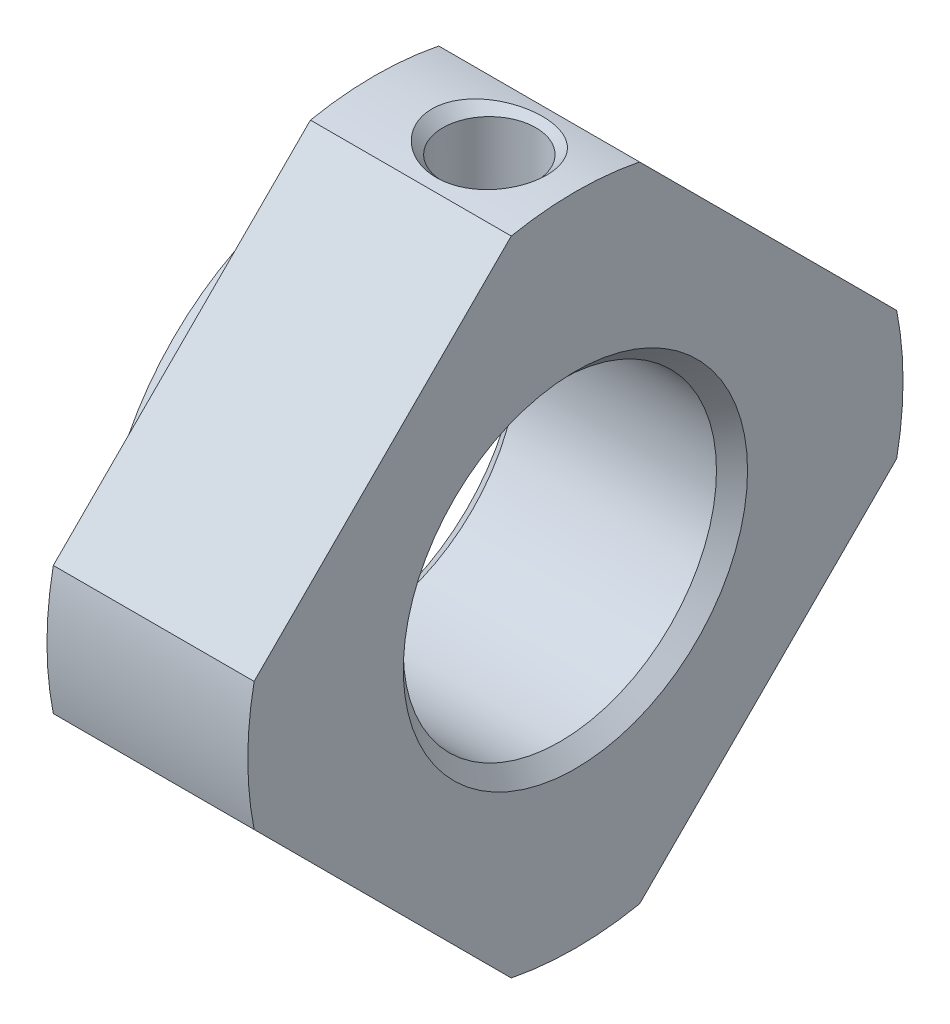
ISO-10303-21;
HEADER;
FILE_DESCRIPTION(('STEP AP214'),'2;1');
FILE_NAME('part.step','',(''),(''),'','','');
FILE_SCHEMA(('AUTOMOTIVE_DESIGN { 1 0 10303 214 1 1 1 1 }'));
ENDSEC;
DATA;
#1=APPLICATION_CONTEXT('core data for automotive mechanical design processes');
#2=APPLICATION_PROTOCOL_DEFINITION('international standard','automotive_design',2000,#1);
#3=PRODUCT_CONTEXT('',#1,'mechanical');
#4=PRODUCT('Part','Part','',(#3));
#5=PRODUCT_RELATED_PRODUCT_CATEGORY('part','',(#4));
#6=PRODUCT_DEFINITION_FORMATION('','',#4);
#7=PRODUCT_DEFINITION_CONTEXT('part definition',#1,'design');
#8=PRODUCT_DEFINITION('design','',#6,#7);
#9=PRODUCT_DEFINITION_SHAPE('','',#8);
#10=(LENGTH_UNIT() NAMED_UNIT(*) SI_UNIT(.MILLI.,.METRE.));
#11=(NAMED_UNIT(*) PLANE_ANGLE_UNIT() SI_UNIT($,.RADIAN.));
#12=(NAMED_UNIT(*) SI_UNIT($,.STERADIAN.) SOLID_ANGLE_UNIT());
#13=UNCERTAINTY_MEASURE_WITH_UNIT(LENGTH_MEASURE(1.E-05),#10,'distance_accuracy_value','');
#14=(GEOMETRIC_REPRESENTATION_CONTEXT(3) GLOBAL_UNCERTAINTY_ASSIGNED_CONTEXT((#13)) GLOBAL_UNIT_ASSIGNED_CONTEXT((#10,
#11,#12)) REPRESENTATION_CONTEXT('',''));
#15=CARTESIAN_POINT('',(0.,0.,0.));
#16=DIRECTION('',(0.,0.,1.));
#17=DIRECTION('',(1.,0.,0.));
#18=AXIS2_PLACEMENT_3D('',#15,#16,#17);
#19=CARTESIAN_POINT('',(27.5,3.00520382004283,-3.00520382004283));
#20=DIRECTION('',(-1.,0.,0.));
#21=DIRECTION('',(0.,0.,1.));
#22=AXIS2_PLACEMENT_3D('',#19,#20,#21);
#23=PLANE('',#22);
#24=CARTESIAN_POINT('',(27.5,0.,0.));
#25=DIRECTION('',(1.,0.,0.));
#26=DIRECTION('',(0.,0.,-1.));
#27=AXIS2_PLACEMENT_3D('',#24,#25,#26);
#28=CIRCLE('',#27,8.5);
#29=CARTESIAN_POINT('',(27.5,0.,-8.5));
#30=VERTEX_POINT('',#29);
#31=EDGE_CURVE('E128',#30,#30,#28,.T.);
#32=ORIENTED_EDGE('',*,*,#31,.F.);
#33=EDGE_LOOP('',(#32));
#34=FACE_BOUND('',#33,.T.);
#35=CARTESIAN_POINT('',(27.5000000000318,0.,0.));
#36=DIRECTION('',(-1.,0.,0.));
#37=DIRECTION('',(0.,0.,1.));
#38=AXIS2_PLACEMENT_3D('',#35,#36,#37);
#39=CIRCLE('',#38,5.99999999997382);
#40=CARTESIAN_POINT('',(27.5000000000318,0.,5.99999999997382));
#41=VERTEX_POINT('',#40);
#42=EDGE_CURVE('E19',#41,#41,#39,.F.);
#43=ORIENTED_EDGE('',*,*,#42,.T.);
#44=EDGE_LOOP('',(#43));
#45=FACE_BOUND('',#44,.T.);
#46=ADVANCED_FACE('F16',(#34,#45),#23,.T.);
#47=CARTESIAN_POINT('',(27.4999999999181,0.,0.));
#48=DIRECTION('',(-1.,0.,0.));
#49=DIRECTION('',(0.,0.,1.));
#50=AXIS2_PLACEMENT_3D('',#47,#48,#49);
#51=CONICAL_SURFACE('',#50,6.00000000008751,0.78539816337393);
#52=CARTESIAN_POINT('',(28.0415,0.,0.));
#53=DIRECTION('',(1.,0.,0.));
#54=DIRECTION('',(0.,0.,-1.));
#55=AXIS2_PLACEMENT_3D('',#52,#53,#54);
#56=CIRCLE('',#55,5.4585);
#57=CARTESIAN_POINT('',(28.0415,0.,-5.4585));
#58=VERTEX_POINT('',#57);
#59=EDGE_CURVE('E126',#58,#58,#56,.T.);
#60=ORIENTED_EDGE('',*,*,#59,.T.);
#61=EDGE_LOOP('',(#60));
#62=FACE_BOUND('',#61,.T.);
#63=ORIENTED_EDGE('',*,*,#42,.F.);
#64=EDGE_LOOP('',(#63));
#65=FACE_BOUND('',#64,.T.);
#66=ADVANCED_FACE('F218',(#62,#65),#51,.F.);
#67=CARTESIAN_POINT('',(32.5,5.52038725808137,0.));
#68=DIRECTION('',(0.,-1.,0.));
#69=DIRECTION('',(0.,0.,-1.));
#70=AXIS2_PLACEMENT_3D('',#67,#68,#69);
#71=CYLINDRICAL_SURFACE('',#70,1.621);
#72=CARTESIAN_POINT('',(34.121,5.4585,0.));
#73=CARTESIAN_POINT('',(34.1209961886155,5.45849743623701,0.0889206585538135));
#74=CARTESIAN_POINT('',(34.113654997219,5.45630490165427,0.177888735296105));
#75=CARTESIAN_POINT('',(34.084536910865,5.44776573714506,0.353272767348448));
#76=CARTESIAN_POINT('',(34.0627467681571,5.44141529504247,0.439686304466254));
#77=CARTESIAN_POINT('',(34.0055224305635,5.42525856871914,0.607351492799735));
#78=CARTESIAN_POINT('',(33.9701114372025,5.41545816350175,0.688611649492608));
#79=CARTESIAN_POINT('',(33.8867353981946,5.39342239097826,0.844029913027432));
#80=CARTESIAN_POINT('',(33.8387702475975,5.3811870033164,0.918187960490084));
#81=CARTESIAN_POINT('',(33.7302177277437,5.35520078563058,1.05940394948613));
#82=CARTESIAN_POINT('',(33.6693403170053,5.34141932361196,1.12623329643226));
#83=CARTESIAN_POINT('',(33.5373088004777,5.31407809936427,1.24890115724466));
#84=CARTESIAN_POINT('',(33.4661528256401,5.30051837795667,1.30473766780679));
#85=CARTESIAN_POINT('',(33.3136654500253,5.27483390580349,1.40502518157018));
#86=CARTESIAN_POINT('',(33.2321449632029,5.26274719111901,1.4491993342705));
#87=CARTESIAN_POINT('',(33.0624158617074,5.24183336856109,1.52311899878821));
#88=CARTESIAN_POINT('',(32.9742088337975,5.23300549024342,1.55286792149689));
#89=CARTESIAN_POINT('',(32.7961692555644,5.21992715838836,1.59627293865551));
#90=CARTESIAN_POINT('',(32.706448083657,5.21555752071649,1.61034902126006));
#91=CARTESIAN_POINT('',(32.5258193785475,5.21153570655092,1.62332007558974));
#92=CARTESIAN_POINT('',(32.4349121302007,5.21188241745167,1.62221862775439));
#93=CARTESIAN_POINT('',(32.2578940590897,5.21714839715069,1.6051961073405));
#94=CARTESIAN_POINT('',(32.1717271953187,5.22190583905855,1.58979948675403));
#95=CARTESIAN_POINT('',(32.0032587345288,5.23519573019746,1.54547016424812));
#96=CARTESIAN_POINT('',(31.9209575326809,5.24372856444653,1.51653608174847));
#97=CARTESIAN_POINT('',(31.7612642444718,5.2637384501903,1.44556215764327));
#98=CARTESIAN_POINT('',(31.6839534725747,5.27525370949486,1.40335058892701));
#99=CARTESIAN_POINT('',(31.5373407239325,5.29991150605148,1.30714192458887));
#100=CARTESIAN_POINT('',(31.468040181307,5.31305433382712,1.25314272353973));
#101=CARTESIAN_POINT('',(31.3364437148988,5.34014278510104,1.13228923835277));
#102=CARTESIAN_POINT('',(31.2745478729898,5.35409930723367,1.06500106888445));
#103=CARTESIAN_POINT('',(31.1628033114902,5.38077348874249,0.920797271284167));
#104=CARTESIAN_POINT('',(31.1129597698257,5.39349061425172,0.843877526685428));
#105=CARTESIAN_POINT('',(31.0264975121381,5.41636736276875,0.681855027854556));
#106=CARTESIAN_POINT('',(30.9899762177362,5.4265079873945,0.596697536899453));
#107=CARTESIAN_POINT('',(30.9319565349538,5.44293648039843,0.421175800449859));
#108=CARTESIAN_POINT('',(30.9104271292629,5.44923230010362,0.330822726385305));
#109=CARTESIAN_POINT('',(30.8908513191087,5.45499014012378,0.199726232576861));
#110=CARTESIAN_POINT('',(30.8864119958305,5.45630273196246,0.159928368441251));
#111=CARTESIAN_POINT('',(30.8804852461224,5.45805837825115,0.0800936220278539));
#112=CARTESIAN_POINT('',(30.8789978310507,5.4585014293554,0.040056738830981));
#113=CARTESIAN_POINT('',(30.879004811151,5.45849682941205,-0.0888536283595229));
#114=CARTESIAN_POINT('',(30.8863389503648,5.45630664348281,-0.17780495409913));
#115=CARTESIAN_POINT('',(30.9154442680936,5.44777129150553,-0.35320680804383));
#116=CARTESIAN_POINT('',(30.9372409792289,5.44141877741786,-0.43965263076351));
#117=CARTESIAN_POINT('',(30.9944807265443,5.42525765441628,-0.607358521486695));
#118=CARTESIAN_POINT('',(31.0298962091286,5.41545602715085,-0.68862867643747));
#119=CARTESIAN_POINT('',(31.1132749962464,5.39341975895458,-0.844046513091637));
#120=CARTESIAN_POINT('',(31.1612356986506,5.38118562270082,-0.918195667477493));
#121=CARTESIAN_POINT('',(31.2697761002246,5.35520221920627,-1.05939594950148));
#122=CARTESIAN_POINT('',(31.3306457476413,5.34142232832322,-1.12621855631329));
#123=CARTESIAN_POINT('',(31.4626762092437,5.31408108504718,-1.24888902346652));
#124=CARTESIAN_POINT('',(31.5338411349633,5.3005198223821,-1.30473247804267));
#125=CARTESIAN_POINT('',(31.6863699856458,5.274827500423,-1.4050497318084));
#126=CARTESIAN_POINT('',(31.767926244021,5.26273516125766,-1.44924165400647));
#127=CARTESIAN_POINT('',(31.9376795037206,5.24182486763569,-1.52314922914898));
#128=CARTESIAN_POINT('',(32.0258683253884,5.23300295703768,-1.55288238610646));
#129=CARTESIAN_POINT('',(32.1787320695568,5.22176866410543,-1.59015704805108));
#130=CARTESIAN_POINT('',(32.2423758738042,5.21822206471239,-1.60170095840048));
#131=CARTESIAN_POINT('',(32.3706714132873,5.21346319757077,-1.61712360936526));
#132=CARTESIAN_POINT('',(32.4353230849455,5.21225078317488,-1.62100283152206));
#133=CARTESIAN_POINT('',(32.5888233147465,5.21225602487028,-1.62099611136099));
#134=CARTESIAN_POINT('',(32.677694240037,5.21454990902273,-1.6136704390148));
#135=CARTESIAN_POINT('',(32.852876102856,5.22344941293933,-1.58461959405366));
#136=CARTESIAN_POINT('',(32.9391845436766,5.23005910233262,-1.56288083018005));
#137=CARTESIAN_POINT('',(33.1066278750054,5.24677479987347,-1.50580625277781));
#138=CARTESIAN_POINT('',(33.1877720899323,5.25687428185043,-1.4704958055549));
#139=CARTESIAN_POINT('',(33.3429913036853,5.27942305485905,-1.38735783534013));
#140=CARTESIAN_POINT('',(33.4170662887768,5.29187235045595,-1.33953028802991));
#141=CARTESIAN_POINT('',(33.5583541813039,5.31815154067366,-1.23112799508929));
#142=CARTESIAN_POINT('',(33.6253162264031,5.33201037206857,-1.17023323125493));
#143=CARTESIAN_POINT('',(33.7482571689267,5.35930272116547,-1.03809494581458));
#144=CARTESIAN_POINT('',(33.8042324871722,5.37273609907492,-0.966848064879404));
#145=CARTESIAN_POINT('',(33.9046992654535,5.39799437896844,-0.814234818856837));
#146=CARTESIAN_POINT('',(33.9489301749715,5.40978040980222,-0.73269010726574));
#147=CARTESIAN_POINT('',(34.0229133623526,5.43006179605436,-0.562960320124672));
#148=CARTESIAN_POINT('',(34.0526826106671,5.43856100608563,-0.474783168675178));
#149=CARTESIAN_POINT('',(34.0900491628168,5.44936985520847,-0.321826382069556));
#150=CARTESIAN_POINT('',(34.1016338173234,5.45277521754963,-0.258069839379326));
#151=CARTESIAN_POINT('',(34.117110414871,5.45734116278398,-0.129550551964768));
#152=CARTESIAN_POINT('',(34.1210027769863,5.45850186796551,-0.064787862248856));
#153=CARTESIAN_POINT('',(34.121,5.4585,0.));
#154=B_SPLINE_CURVE_WITH_KNOTS('',3,(#72,#73,#74,#75,#76,#77,#78,#79,#80,#81,#82,#83,#84,#85,
#86,#87,#88,#89,#90,#91,#92,#93,#94,#95,#96,#97,#98,#99,#100,#101,#102,#103,#104,#105,#106,#107,
#108,#109,#110,#111,#112,#113,#114,#115,#116,#117,#118,#119,#120,#121,#122,#123,#124,#125,#126,
#127,#128,#129,#130,#131,#132,#133,#134,#135,#136,#137,#138,#139,#140,#141,#142,#143,#144,#145,
#146,#147,#148,#149,#150,#151,#152,#153),.UNSPECIFIED.,.T.,.F.,(4,2,2,2,2,2,2,2,2,2,2,2,2,2,2,2,
2,2,2,2,2,2,2,2,2,2,2,2,2,2,2,2,2,2,2,2,2,2,2,2,4),(0.,0.26652021598874,0.533285133775967,
0.799597646754547,1.06591238612386,1.33900151797797,1.61214037086847,1.89127534098169,
2.1703442765238,2.44174010967952,2.71307192058006,2.97482668868271,3.2366081569342,
3.50192521708651,3.76728970521141,4.04345868744016,4.31974610780301,4.59801524667118,
4.87570693913836,4.99580722068861,5.11590796435144,5.38231474519665,5.64919310371663,
5.91553432899406,6.18182035352548,6.45487966978344,6.7280483379025,7.00731976714434,
7.28625225898179,7.48011870212588,7.6739729650366,7.94020053935682,8.20667951872104,
8.47266283576829,8.73864666957479,9.01209373193519,9.28562972864552,9.56480511596207,
9.84365210075378,10.0378501208238,10.2320375607376),.UNSPECIFIED.);
#155=CARTESIAN_POINT('',(34.121,5.4585,0.));
#156=VERTEX_POINT('',#155);
#157=EDGE_CURVE('E125',#156,#156,#154,.T.);
#158=ORIENTED_EDGE('',*,*,#157,.T.);
#159=EDGE_LOOP('',(#158));
#160=FACE_BOUND('',#159,.T.);
#161=CARTESIAN_POINT('',(32.5,11.0407745161183,0.));
#162=DIRECTION('',(0.,1.,0.));
#163=DIRECTION('',(1.,0.,0.));
#164=AXIS2_PLACEMENT_3D('',#161,#162,#163);
#165=CIRCLE('',#164,1.62099999997053);
#166=CARTESIAN_POINT('',(34.1209999999705,11.0407745161183,0.));
#167=VERTEX_POINT('',#166);
#168=EDGE_CURVE('E122',#167,#167,#165,.T.);
#169=ORIENTED_EDGE('',*,*,#168,.T.);
#170=EDGE_LOOP('',(#169));
#171=FACE_BOUND('',#170,.T.);
#172=ADVANCED_FACE('F221',(#160,#171),#71,.F.);
#173=CARTESIAN_POINT('',(28.,0.,0.));
#174=DIRECTION('',(1.,0.,0.));
#175=DIRECTION('',(0.,0.,-1.));
#176=AXIS2_PLACEMENT_3D('',#173,#174,#175);
#177=CYLINDRICAL_SURFACE('',#176,8.5);
#178=ORIENTED_EDGE('',*,*,#31,.T.);
#179=EDGE_LOOP('',(#178));
#180=FACE_BOUND('',#179,.T.);
#181=CARTESIAN_POINT('',(28.5,0.,0.));
#182=DIRECTION('',(1.,0.,0.));
#183=DIRECTION('',(0.,0.,-1.));
#184=AXIS2_PLACEMENT_3D('',#181,#182,#183);
#185=CIRCLE('',#184,8.5);
#186=CARTESIAN_POINT('',(28.5,0.,-8.5));
#187=VERTEX_POINT('',#186);
#188=EDGE_CURVE('E121',#187,#187,#185,.T.);
#189=ORIENTED_EDGE('',*,*,#188,.F.);
#190=EDGE_LOOP('',(#189));
#191=FACE_BOUND('',#190,.T.);
#192=ADVANCED_FACE('F212',(#180,#191),#177,.T.);
#193=CARTESIAN_POINT('',(31.5,0.,0.));
#194=DIRECTION('',(1.,0.,0.));
#195=DIRECTION('',(0.,0.,-1.));
#196=AXIS2_PLACEMENT_3D('',#193,#194,#195);
#197=CYLINDRICAL_SURFACE('',#196,5.4585);
#198=CARTESIAN_POINT('',(34.9585000000729,0.,0.));
#199=DIRECTION('',(1.,0.,0.));
#200=DIRECTION('',(0.,0.707106781191754,-0.707106781181341));
#201=AXIS2_PLACEMENT_3D('',#198,#199,#200);
#202=CIRCLE('',#201,5.45850000000221);
#203=CARTESIAN_POINT('',(34.9585000000729,3.85974236513675,-3.85974236507991));
#204=VERTEX_POINT('',#203);
#205=EDGE_CURVE('E115',#204,#204,#202,.T.);
#206=ORIENTED_EDGE('',*,*,#205,.T.);
#207=EDGE_LOOP('',(#206));
#208=FACE_BOUND('',#207,.T.);
#209=ORIENTED_EDGE('',*,*,#157,.F.);
#210=EDGE_LOOP('',(#209));
#211=FACE_BOUND('',#210,.T.);
#212=ORIENTED_EDGE('',*,*,#59,.F.);
#213=EDGE_LOOP('',(#212));
#214=FACE_BOUND('',#213,.T.);
#215=ADVANCED_FACE('F192',(#208,#211,#214),#197,.F.);
#216=CARTESIAN_POINT('',(32.5,11.4220485160672,0.));
#217=DIRECTION('',(0.,1.,0.));
#218=DIRECTION('',(0.,0.,1.));
#219=AXIS2_PLACEMENT_3D('',#216,#217,#218);
#220=CONICAL_SURFACE('',#219,2.00227399991945,0.785398163397448);
#221=ORIENTED_EDGE('',*,*,#168,.F.);
#222=EDGE_LOOP('',(#221));
#223=FACE_BOUND('',#222,.T.);
#224=CARTESIAN_POINT('',(34.5000000000149,11.4197745161627,0.));
#225=CARTESIAN_POINT('',(34.4999941499019,11.4197727655796,0.0994875831042441));
#226=CARTESIAN_POINT('',(34.491224091906,11.4184581870759,0.199125114776996));
#227=CARTESIAN_POINT('',(34.4565148715457,11.4133508338645,0.395431044957858));
#228=CARTESIAN_POINT('',(34.4305373203595,11.409552518341,0.492092297843787));
#229=CARTESIAN_POINT('',(34.3640006141568,11.4001288573928,0.675576376469557));
#230=CARTESIAN_POINT('',(34.3240941756522,11.3945862388823,0.762641327297832));
#231=CARTESIAN_POINT('',(34.2311095271603,11.3822120755062,0.929238851068744));
#232=CARTESIAN_POINT('',(34.1780365092973,11.3753810389707,1.0087743761335));
#233=CARTESIAN_POINT('',(34.0569336315231,11.3606564157836,1.16323430494634));
#234=CARTESIAN_POINT('',(33.9882029011001,11.3527238248726,1.23760467388356));
#235=CARTESIAN_POINT('',(33.840015638807,11.3369323080981,1.37477060259231));
#236=CARTESIAN_POINT('',(33.7605542612448,11.3290734172404,1.43756090261296));
#237=CARTESIAN_POINT('',(33.5863911908744,11.3135753729889,1.55500953110717));
#238=CARTESIAN_POINT('',(33.490980304287,11.3060032489396,1.60862587312343));
#239=CARTESIAN_POINT('',(33.2928184345414,11.2925920428021,1.70022450794446));
#240=CARTESIAN_POINT('',(33.190065405833,11.2867534460356,1.73820242373409));
#241=CARTESIAN_POINT('',(32.9734397747627,11.2771148438365,1.79971399740518));
#242=CARTESIAN_POINT('',(32.8592708478516,11.2734601762491,1.82223038323829));
#243=CARTESIAN_POINT('',(32.6287360043332,11.2691731524432,1.84855735515637));
#244=CARTESIAN_POINT('',(32.5123697109535,11.2685413193483,1.85236470350871));
#245=CARTESIAN_POINT('',(32.277496689203,11.2703955810692,1.84105154816222));
#246=CARTESIAN_POINT('',(32.159014339814,11.2729642591193,1.82542973010839));
#247=CARTESIAN_POINT('',(31.9263855050091,11.2810629875564,1.77468901263029));
#248=CARTESIAN_POINT('',(31.8122394373828,11.2865933225203,1.73956823959663));
#249=CARTESIAN_POINT('',(31.5920261539413,11.2999397995278,1.65064142976966));
#250=CARTESIAN_POINT('',(31.4859339842897,11.3077484848979,1.59689624165888));
#251=CARTESIAN_POINT('',(31.2848155528144,11.3247141334314,1.47175750986445));
#252=CARTESIAN_POINT('',(31.1897873421787,11.333870858505,1.40036708116261));
#253=CARTESIAN_POINT('',(31.0175279401797,11.3520216832855,1.24449388221329));
#254=CARTESIAN_POINT('',(30.9397642133924,11.3610090645174,1.16060036251935));
#255=CARTESIAN_POINT('',(30.8007673795143,11.3780152508686,0.979907331600733));
#256=CARTESIAN_POINT('',(30.7395332908561,11.3860341134852,0.883108587227762));
#257=CARTESIAN_POINT('',(30.6403828060021,11.3994744083439,0.687132972390269));
#258=CARTESIAN_POINT('',(30.6010668314366,11.4050450671979,0.588673226551313));
#259=CARTESIAN_POINT('',(30.5410443478022,11.4136846773793,0.38630024153933));
#260=CARTESIAN_POINT('',(30.5202840983493,11.4167608507246,0.282403679496009));
#261=CARTESIAN_POINT('',(30.5061960003211,11.4188524096086,0.148134787711536));
#262=CARTESIAN_POINT('',(30.5038749697676,11.4191974684681,0.118560984363502));
#263=CARTESIAN_POINT('',(30.5007760671146,11.4196587872578,0.0593292353655991));
#264=CARTESIAN_POINT('',(30.4999982552409,11.4197750382585,0.0296712864770879));
#265=CARTESIAN_POINT('',(30.5000058500981,11.4197727655796,-0.0994875831042423));
#266=CARTESIAN_POINT('',(30.508775908094,11.4184581870759,-0.199125114776995));
#267=CARTESIAN_POINT('',(30.5434851284543,11.4133508338645,-0.395431044957856));
#268=CARTESIAN_POINT('',(30.5694626796405,11.409552518341,-0.492092297843785));
#269=CARTESIAN_POINT('',(30.6359993858432,11.4001288573928,-0.675576376469554));
#270=CARTESIAN_POINT('',(30.6759058243478,11.3945862388823,-0.762641327297831));
#271=CARTESIAN_POINT('',(30.7688904728397,11.3822120755062,-0.929238851068743));
#272=CARTESIAN_POINT('',(30.8219634907027,11.3753810389707,-1.0087743761335));
#273=CARTESIAN_POINT('',(30.9430663684769,11.3606564157836,-1.16323430494634));
#274=CARTESIAN_POINT('',(31.0117970988999,11.3527238248726,-1.23760467388356));
#275=CARTESIAN_POINT('',(31.159984361193,11.3369323080981,-1.37477060259231));
#276=CARTESIAN_POINT('',(31.2394457387552,11.3290734172404,-1.43756090261296));
#277=CARTESIAN_POINT('',(31.4136088091256,11.3135753729889,-1.55500953110717));
#278=CARTESIAN_POINT('',(31.509019695713,11.3060032489396,-1.60862587312343));
#279=CARTESIAN_POINT('',(31.7071815654586,11.2925920428021,-1.70022450794446));
#280=CARTESIAN_POINT('',(31.809934594167,11.2867534460356,-1.73820242373409));
#281=CARTESIAN_POINT('',(32.0265602252373,11.2771148438365,-1.79971399740518));
#282=CARTESIAN_POINT('',(32.1407291521484,11.2734601762491,-1.82223038323828));
#283=CARTESIAN_POINT('',(32.3712639956668,11.2691731524432,-1.84855735515637));
#284=CARTESIAN_POINT('',(32.4876302890465,11.2685413193483,-1.85236470350871));
#285=CARTESIAN_POINT('',(32.722503310797,11.2703955810692,-1.84105154816222));
#286=CARTESIAN_POINT('',(32.840985660186,11.2729642591193,-1.82542973010839));
#287=CARTESIAN_POINT('',(33.0736144949909,11.2810629875564,-1.77468901263029));
#288=CARTESIAN_POINT('',(33.1877605626172,11.2865933225203,-1.73956823959663));
#289=CARTESIAN_POINT('',(33.4079738460587,11.2999397995278,-1.65064142976965));
#290=CARTESIAN_POINT('',(33.5140660157103,11.3077484848979,-1.59689624165887));
#291=CARTESIAN_POINT('',(33.7151844471856,11.3247141334314,-1.47175750986445));
#292=CARTESIAN_POINT('',(33.8102126578213,11.333870858505,-1.40036708116261));
#293=CARTESIAN_POINT('',(33.9824720598203,11.3520216832855,-1.24449388221329));
#294=CARTESIAN_POINT('',(34.0602357866076,11.3610090645174,-1.16060036251935));
#295=CARTESIAN_POINT('',(34.1992326204857,11.3780152508686,-0.979907331600738));
#296=CARTESIAN_POINT('',(34.2604667091439,11.3860341134852,-0.883108587227766));
#297=CARTESIAN_POINT('',(34.3596171939979,11.3994744083439,-0.687132972390272));
#298=CARTESIAN_POINT('',(34.3989331685634,11.4050450671979,-0.588673226551317));
#299=CARTESIAN_POINT('',(34.4589556521978,11.4136846773793,-0.386300241539334));
#300=CARTESIAN_POINT('',(34.4797159016507,11.4167608507246,-0.282403679496012));
#301=CARTESIAN_POINT('',(34.4938039996789,11.4188524096086,-0.148134787711537));
#302=CARTESIAN_POINT('',(34.4961250302324,11.4191974684681,-0.118560984363502));
#303=CARTESIAN_POINT('',(34.4992239328854,11.4196587872578,-0.0593292353655976));
#304=CARTESIAN_POINT('',(34.5000017447591,11.4197750382585,-0.0296712864770861));
#305=CARTESIAN_POINT('',(34.5000000000149,11.4197745161627,0.));
#306=B_SPLINE_CURVE_WITH_KNOTS('',3,(#224,#225,#226,#227,#228,#229,#230,#231,#232,#233,#234,
#235,#236,#237,#238,#239,#240,#241,#242,#243,#244,#245,#246,#247,#248,#249,#250,#251,#252,#253,
#254,#255,#256,#257,#258,#259,#260,#261,#262,#263,#264,#265,#266,#267,#268,#269,#270,#271,#272,
#273,#274,#275,#276,#277,#278,#279,#280,#281,#282,#283,#284,#285,#286,#287,#288,#289,#290,#291,
#292,#293,#294,#295,#296,#297,#298,#299,#300,#301,#302,#303,#304,#305),.UNSPECIFIED.,.T.,.F.,(4,
2,2,2,2,2,2,2,2,2,2,2,2,2,2,2,2,2,2,2,2,2,2,2,2,2,2,2,2,2,2,2,2,2,2,2,2,2,2,2,4),(0.,
0.298338349790301,0.597344525228967,0.883891221380903,1.17032509949198,1.47376304814603,
1.7773384828834,2.10502544086517,2.43280405240925,2.78048873926797,3.12823359332801,
3.48514010494892,3.84208091682601,4.19786637768405,4.55358907517742,4.89601278291427,
5.23841615227901,5.55525555710707,5.87117434221565,5.96014762838237,6.0491243867629,
6.3474627365532,6.64646891199186,6.9330156081438,7.21944948625488,7.52288743490893,
7.82646286964629,8.15414982762806,8.48192843917215,8.82961312603086,9.1773579800909,
9.53426449171182,9.89120530358891,10.2469907644469,10.6027134619403,10.9451371696772,
11.2875405390419,11.60437994387,11.9202987289785,12.0092720151453,12.0982487735258),.UNSPECIFIED.);
#307=CARTESIAN_POINT('',(34.5000000000149,11.4197745161627,0.));
#308=VERTEX_POINT('',#307);
#309=EDGE_CURVE('E149',#308,#308,#306,.T.);
#310=ORIENTED_EDGE('',*,*,#309,.F.);
#311=EDGE_LOOP('',(#310));
#312=FACE_BOUND('',#311,.T.);
#313=ADVANCED_FACE('F156',(#223,#312),#220,.F.);
#314=CARTESIAN_POINT('',(28.5,7.04270382004283,-7.04270382004283));
#315=DIRECTION('',(-1.,0.,0.));
#316=DIRECTION('',(0.,0.,1.));
#317=AXIS2_PLACEMENT_3D('',#314,#315,#316);
#318=PLANE('',#317);
#319=ORIENTED_EDGE('',*,*,#188,.T.);
#320=EDGE_LOOP('',(#319));
#321=FACE_BOUND('',#320,.T.);
#322=DIRECTION('',(0.,-0.707106781186548,0.707106781186547));
#323=VECTOR('',#322,1.);
#324=CARTESIAN_POINT('',(28.5,-13.4350288425444,0.));
#325=LINE('',#324,#323);
#326=CARTESIAN_POINT('',(28.5,-2.23637338354533,-11.198655458999));
#327=VERTEX_POINT('',#326);
#328=CARTESIAN_POINT('',(28.5,-11.1986554589991,-2.23637338354533));
#329=VERTEX_POINT('',#328);
#330=EDGE_CURVE('E82',#327,#329,#325,.T.);
#331=ORIENTED_EDGE('',*,*,#330,.T.);
#332=CARTESIAN_POINT('',(28.5,0.,0.));
#333=DIRECTION('',(1.,0.,0.));
#334=DIRECTION('',(0.,0.,-1.));
#335=AXIS2_PLACEMENT_3D('',#332,#333,#334);
#336=CIRCLE('',#335,11.4197745161627);
#337=CARTESIAN_POINT('',(28.5,-11.198655458999,2.23637338354533));
#338=VERTEX_POINT('',#337);
#339=EDGE_CURVE('E85',#338,#329,#336,.T.);
#340=ORIENTED_EDGE('',*,*,#339,.F.);
#341=DIRECTION('',(0.,0.707106781186547,0.707106781186548));
#342=VECTOR('',#341,1.);
#343=CARTESIAN_POINT('',(28.5,0.,13.4350288425444));
#344=LINE('',#343,#342);
#345=CARTESIAN_POINT('',(28.5,-2.23637338354533,11.198655458999));
#346=VERTEX_POINT('',#345);
#347=EDGE_CURVE('E77',#338,#346,#344,.T.);
#348=ORIENTED_EDGE('',*,*,#347,.T.);
#349=CARTESIAN_POINT('',(28.5,0.,0.));
#350=DIRECTION('',(1.,0.,0.));
#351=DIRECTION('',(0.,0.,-1.));
#352=AXIS2_PLACEMENT_3D('',#349,#350,#351);
#353=CIRCLE('',#352,11.4197745161627);
#354=CARTESIAN_POINT('',(28.5,2.23637338354533,11.198655458999));
#355=VERTEX_POINT('',#354);
#356=EDGE_CURVE('E143',#355,#346,#353,.T.);
#357=ORIENTED_EDGE('',*,*,#356,.F.);
#358=DIRECTION('',(0.,0.707106781186548,-0.707106781186547));
#359=VECTOR('',#358,1.);
#360=CARTESIAN_POINT('',(28.5,13.4350288425444,0.));
#361=LINE('',#360,#359);
#362=CARTESIAN_POINT('',(28.5,11.1986554589991,2.23637338354533));
#363=VERTEX_POINT('',#362);
#364=EDGE_CURVE('E110',#355,#363,#361,.T.);
#365=ORIENTED_EDGE('',*,*,#364,.T.);
#366=CARTESIAN_POINT('',(28.5,0.,0.));
#367=DIRECTION('',(1.,0.,0.));
#368=DIRECTION('',(0.,0.,-1.));
#369=AXIS2_PLACEMENT_3D('',#366,#367,#368);
#370=CIRCLE('',#369,11.4197745161627);
#371=CARTESIAN_POINT('',(28.5,11.198655458999,-2.23637338354533));
#372=VERTEX_POINT('',#371);
#373=EDGE_CURVE('E113',#372,#363,#370,.T.);
#374=ORIENTED_EDGE('',*,*,#373,.F.);
#375=DIRECTION('',(0.,-0.707106781186547,-0.707106781186548));
#376=VECTOR('',#375,1.);
#377=CARTESIAN_POINT('',(28.5,0.,-13.4350288425444));
#378=LINE('',#377,#376);
#379=CARTESIAN_POINT('',(28.5,2.23637338354533,-11.1986554589991));
#380=VERTEX_POINT('',#379);
#381=EDGE_CURVE('E116',#372,#380,#378,.T.);
#382=ORIENTED_EDGE('',*,*,#381,.T.);
#383=CARTESIAN_POINT('',(28.5,0.,0.));
#384=DIRECTION('',(1.,0.,0.));
#385=DIRECTION('',(0.,0.,-1.));
#386=AXIS2_PLACEMENT_3D('',#383,#384,#385);
#387=CIRCLE('',#386,11.4197745161627);
#388=EDGE_CURVE('E88',#327,#380,#387,.T.);
#389=ORIENTED_EDGE('',*,*,#388,.F.);
#390=EDGE_LOOP('',(#331,#340,#348,#357,#365,#374,#382,#389));
#391=FACE_BOUND('',#390,.T.);
#392=ADVANCED_FACE('F84',(#321,#391),#318,.T.);
#393=CARTESIAN_POINT('',(35.4999999999563,0.,0.));
#394=DIRECTION('',(1.,0.,0.));
#395=DIRECTION('',(0.,0.,-1.));
#396=AXIS2_PLACEMENT_3D('',#393,#394,#395);
#397=CONICAL_SURFACE('',#396,5.99999999992673,0.785398163435422);
#398=CARTESIAN_POINT('',(35.5000000000367,0.,0.));
#399=DIRECTION('',(1.,0.,0.));
#400=DIRECTION('',(0.,0.,-1.));
#401=AXIS2_PLACEMENT_3D('',#398,#399,#400);
#402=CIRCLE('',#401,6.00000000000712);
#403=CARTESIAN_POINT('',(35.5000000000367,0.,-6.00000000000712));
#404=VERTEX_POINT('',#403);
#405=EDGE_CURVE('E140',#404,#404,#402,.F.);
#406=ORIENTED_EDGE('',*,*,#405,.F.);
#407=EDGE_LOOP('',(#406));
#408=FACE_BOUND('',#407,.T.);
#409=ORIENTED_EDGE('',*,*,#205,.F.);
#410=EDGE_LOOP('',(#409));
#411=FACE_BOUND('',#410,.T.);
#412=ADVANCED_FACE('F183',(#408,#411),#397,.F.);
#413=CARTESIAN_POINT('',(27.5,0.,13.4350288425444));
#414=DIRECTION('',(0.,0.707106781186548,-0.707106781186547));
#415=DIRECTION('',(0.,0.707106781186547,0.707106781186548));
#416=AXIS2_PLACEMENT_3D('',#413,#414,#415);
#417=PLANE('',#416);
#418=DIRECTION('',(1.,0.,0.));
#419=VECTOR('',#418,1.);
#420=CARTESIAN_POINT('',(32.,-2.2363733835453,11.198655458999));
#421=LINE('',#420,#419);
#422=CARTESIAN_POINT('',(35.5,-2.23637338354535,11.198655458999));
#423=VERTEX_POINT('',#422);
#424=EDGE_CURVE('E393',#346,#423,#421,.T.);
#425=ORIENTED_EDGE('',*,*,#424,.F.);
#426=ORIENTED_EDGE('',*,*,#347,.F.);
#427=DIRECTION('',(1.,0.,0.));
#428=VECTOR('',#427,1.);
#429=CARTESIAN_POINT('',(32.,-11.198655458999,2.23637338354532));
#430=LINE('',#429,#428);
#431=CARTESIAN_POINT('',(35.5,-11.198655458999,2.23637338354535));
#432=VERTEX_POINT('',#431);
#433=EDGE_CURVE('E98',#432,#338,#430,.F.);
#434=ORIENTED_EDGE('',*,*,#433,.F.);
#435=DIRECTION('',(0.,-0.707106781186547,-0.707106781186547));
#436=VECTOR('',#435,1.);
#437=CARTESIAN_POINT('',(35.5,-2.23637338354532,11.1986554589991));
#438=LINE('',#437,#436);
#439=EDGE_CURVE('E139',#423,#432,#438,.T.);
#440=ORIENTED_EDGE('',*,*,#439,.F.);
#441=EDGE_LOOP('',(#425,#426,#434,#440));
#442=FACE_BOUND('',#441,.T.);
#443=ADVANCED_FACE('F180',(#442),#417,.F.);
#444=CARTESIAN_POINT('',(32.,0.,0.));
#445=DIRECTION('',(1.,0.,0.));
#446=DIRECTION('',(0.,0.,-1.));
#447=AXIS2_PLACEMENT_3D('',#444,#445,#446);
#448=CYLINDRICAL_SURFACE('',#447,11.4197745161627);
#449=DIRECTION('',(1.,0.,0.));
#450=VECTOR('',#449,1.);
#451=CARTESIAN_POINT('',(27.5,-11.1986554589991,-2.23637338354531));
#452=LINE('',#451,#450);
#453=CARTESIAN_POINT('',(35.5,-11.1986554589991,-2.23637338354535));
#454=VERTEX_POINT('',#453);
#455=EDGE_CURVE('E92',#329,#454,#452,.T.);
#456=ORIENTED_EDGE('',*,*,#455,.T.);
#457=CARTESIAN_POINT('',(35.5,0.,0.));
#458=DIRECTION('',(1.,0.,0.));
#459=DIRECTION('',(0.,0.,-1.));
#460=AXIS2_PLACEMENT_3D('',#457,#458,#459);
#461=CIRCLE('',#460,11.4197745161627);
#462=EDGE_CURVE('E137',#432,#454,#461,.T.);
#463=ORIENTED_EDGE('',*,*,#462,.F.);
#464=ORIENTED_EDGE('',*,*,#433,.T.);
#465=ORIENTED_EDGE('',*,*,#339,.T.);
#466=EDGE_LOOP('',(#456,#463,#464,#465));
#467=FACE_BOUND('',#466,.T.);
#468=ADVANCED_FACE('F95',(#467),#448,.T.);
#469=CARTESIAN_POINT('',(27.5,-13.4350288425444,0.));
#470=DIRECTION('',(0.,0.707106781186547,0.707106781186548));
#471=DIRECTION('',(0.,-0.707106781186548,0.707106781186547));
#472=AXIS2_PLACEMENT_3D('',#469,#470,#471);
#473=PLANE('',#472);
#474=ORIENTED_EDGE('',*,*,#455,.F.);
#475=ORIENTED_EDGE('',*,*,#330,.F.);
#476=DIRECTION('',(1.,0.,0.));
#477=VECTOR('',#476,1.);
#478=CARTESIAN_POINT('',(32.,-2.23637338354531,-11.198655458999));
#479=LINE('',#478,#477);
#480=CARTESIAN_POINT('',(35.5,-2.23637338354535,-11.198655458999));
#481=VERTEX_POINT('',#480);
#482=EDGE_CURVE('E104',#481,#327,#479,.F.);
#483=ORIENTED_EDGE('',*,*,#482,.F.);
#484=DIRECTION('',(0.,0.707106781186547,-0.707106781186547));
#485=VECTOR('',#484,1.);
#486=CARTESIAN_POINT('',(35.5,-11.1986554589991,-2.23637338354532));
#487=LINE('',#486,#485);
#488=EDGE_CURVE('E102',#454,#481,#487,.T.);
#489=ORIENTED_EDGE('',*,*,#488,.F.);
#490=EDGE_LOOP('',(#474,#475,#483,#489));
#491=FACE_BOUND('',#490,.T.);
#492=ADVANCED_FACE('F100',(#491),#473,.F.);
#493=CARTESIAN_POINT('',(32.,0.,0.));
#494=DIRECTION('',(1.,0.,0.));
#495=DIRECTION('',(0.,0.,-1.));
#496=AXIS2_PLACEMENT_3D('',#493,#494,#495);
#497=CYLINDRICAL_SURFACE('',#496,11.4197745161627);
#498=DIRECTION('',(1.,0.,0.));
#499=VECTOR('',#498,1.);
#500=CARTESIAN_POINT('',(27.5,2.23637338354531,-11.1986554589991));
#501=LINE('',#500,#499);
#502=CARTESIAN_POINT('',(35.5,2.23637338354535,-11.1986554589991));
#503=VERTEX_POINT('',#502);
#504=EDGE_CURVE('E117',#380,#503,#501,.T.);
#505=ORIENTED_EDGE('',*,*,#504,.T.);
#506=CARTESIAN_POINT('',(35.5,0.,0.));
#507=DIRECTION('',(1.,0.,0.));
#508=DIRECTION('',(0.,0.,-1.));
#509=AXIS2_PLACEMENT_3D('',#506,#507,#508);
#510=CIRCLE('',#509,11.4197745161627);
#511=EDGE_CURVE('E134',#481,#503,#510,.T.);
#512=ORIENTED_EDGE('',*,*,#511,.F.);
#513=ORIENTED_EDGE('',*,*,#482,.T.);
#514=ORIENTED_EDGE('',*,*,#388,.T.);
#515=EDGE_LOOP('',(#505,#512,#513,#514));
#516=FACE_BOUND('',#515,.T.);
#517=ADVANCED_FACE('F171',(#516),#497,.T.);
#518=CARTESIAN_POINT('',(27.5,0.,-13.4350288425444));
#519=DIRECTION('',(0.,-0.707106781186548,0.707106781186547));
#520=DIRECTION('',(0.,-0.707106781186547,-0.707106781186548));
#521=AXIS2_PLACEMENT_3D('',#518,#519,#520);
#522=PLANE('',#521);
#523=ORIENTED_EDGE('',*,*,#504,.F.);
#524=ORIENTED_EDGE('',*,*,#381,.F.);
#525=DIRECTION('',(1.,0.,0.));
#526=VECTOR('',#525,1.);
#527=CARTESIAN_POINT('',(32.,11.198655458999,-2.23637338354531));
#528=LINE('',#527,#526);
#529=CARTESIAN_POINT('',(35.5,11.198655458999,-2.23637338354535));
#530=VERTEX_POINT('',#529);
#531=EDGE_CURVE('E148',#530,#372,#528,.F.);
#532=ORIENTED_EDGE('',*,*,#531,.F.);
#533=DIRECTION('',(0.,0.707106781186547,0.707106781186547));
#534=VECTOR('',#533,1.);
#535=CARTESIAN_POINT('',(35.5,2.23637338354532,-11.1986554589991));
#536=LINE('',#535,#534);
#537=EDGE_CURVE('E133',#503,#530,#536,.T.);
#538=ORIENTED_EDGE('',*,*,#537,.F.);
#539=EDGE_LOOP('',(#523,#524,#532,#538));
#540=FACE_BOUND('',#539,.T.);
#541=ADVANCED_FACE('F166',(#540),#522,.F.);
#542=CARTESIAN_POINT('',(32.,0.,0.));
#543=DIRECTION('',(1.,0.,0.));
#544=DIRECTION('',(0.,0.,-1.));
#545=AXIS2_PLACEMENT_3D('',#542,#543,#544);
#546=CYLINDRICAL_SURFACE('',#545,11.4197745161627);
#547=DIRECTION('',(1.,0.,0.));
#548=VECTOR('',#547,1.);
#549=CARTESIAN_POINT('',(27.5,11.1986554589991,2.23637338354531));
#550=LINE('',#549,#548);
#551=CARTESIAN_POINT('',(35.5,11.1986554589991,2.23637338354535));
#552=VERTEX_POINT('',#551);
#553=EDGE_CURVE('E112',#363,#552,#550,.T.);
#554=ORIENTED_EDGE('',*,*,#553,.T.);
#555=CARTESIAN_POINT('',(35.5,0.,0.));
#556=DIRECTION('',(1.,0.,0.));
#557=DIRECTION('',(0.,0.,-1.));
#558=AXIS2_PLACEMENT_3D('',#555,#556,#557);
#559=CIRCLE('',#558,11.4197745161627);
#560=EDGE_CURVE('E130',#530,#552,#559,.T.);
#561=ORIENTED_EDGE('',*,*,#560,.F.);
#562=ORIENTED_EDGE('',*,*,#531,.T.);
#563=ORIENTED_EDGE('',*,*,#373,.T.);
#564=EDGE_LOOP('',(#554,#561,#562,#563));
#565=FACE_BOUND('',#564,.T.);
#566=ORIENTED_EDGE('',*,*,#309,.T.);
#567=EDGE_LOOP('',(#566));
#568=FACE_BOUND('',#567,.T.);
#569=ADVANCED_FACE('F160',(#565,#568),#546,.T.);
#570=CARTESIAN_POINT('',(27.5,13.4350288425444,0.));
#571=DIRECTION('',(0.,-0.707106781186547,-0.707106781186548));
#572=DIRECTION('',(0.,0.707106781186548,-0.707106781186547));
#573=AXIS2_PLACEMENT_3D('',#570,#571,#572);
#574=PLANE('',#573);
#575=ORIENTED_EDGE('',*,*,#553,.F.);
#576=ORIENTED_EDGE('',*,*,#364,.F.);
#577=DIRECTION('',(1.,0.,0.));
#578=VECTOR('',#577,1.);
#579=CARTESIAN_POINT('',(32.,2.23637338354531,11.198655458999));
#580=LINE('',#579,#578);
#581=CARTESIAN_POINT('',(35.5,2.23637338354535,11.198655458999));
#582=VERTEX_POINT('',#581);
#583=EDGE_CURVE('E34',#582,#355,#580,.F.);
#584=ORIENTED_EDGE('',*,*,#583,.F.);
#585=DIRECTION('',(0.,-0.707106781186547,0.707106781186547));
#586=VECTOR('',#585,1.);
#587=CARTESIAN_POINT('',(35.5,11.1986554589991,2.23637338354532));
#588=LINE('',#587,#586);
#589=EDGE_CURVE('E25',#552,#582,#588,.T.);
#590=ORIENTED_EDGE('',*,*,#589,.F.);
#591=EDGE_LOOP('',(#575,#576,#584,#590));
#592=FACE_BOUND('',#591,.T.);
#593=ADVANCED_FACE('F165',(#592),#574,.F.);
#594=CARTESIAN_POINT('',(32.,0.,0.));
#595=DIRECTION('',(1.,0.,0.));
#596=DIRECTION('',(0.,0.,-1.));
#597=AXIS2_PLACEMENT_3D('',#594,#595,#596);
#598=CYLINDRICAL_SURFACE('',#597,11.4197745161627);
#599=ORIENTED_EDGE('',*,*,#583,.T.);
#600=ORIENTED_EDGE('',*,*,#356,.T.);
#601=ORIENTED_EDGE('',*,*,#424,.T.);
#602=CARTESIAN_POINT('',(35.5,0.,0.));
#603=DIRECTION('',(1.,0.,0.));
#604=DIRECTION('',(0.,0.,-1.));
#605=AXIS2_PLACEMENT_3D('',#602,#603,#604);
#606=CIRCLE('',#605,11.4197745161627);
#607=EDGE_CURVE('E10',#582,#423,#606,.T.);
#608=ORIENTED_EDGE('',*,*,#607,.F.);
#609=EDGE_LOOP('',(#599,#600,#601,#608));
#610=FACE_BOUND('',#609,.T.);
#611=ADVANCED_FACE('F197',(#610),#598,.T.);
#612=CARTESIAN_POINT('',(35.5,4.0375,-4.0375));
#613=DIRECTION('',(1.,0.,0.));
#614=DIRECTION('',(0.,0.,-1.));
#615=AXIS2_PLACEMENT_3D('',#612,#613,#614);
#616=PLANE('',#615);
#617=ORIENTED_EDGE('',*,*,#589,.T.);
#618=ORIENTED_EDGE('',*,*,#607,.T.);
#619=ORIENTED_EDGE('',*,*,#439,.T.);
#620=ORIENTED_EDGE('',*,*,#462,.T.);
#621=ORIENTED_EDGE('',*,*,#488,.T.);
#622=ORIENTED_EDGE('',*,*,#511,.T.);
#623=ORIENTED_EDGE('',*,*,#537,.T.);
#624=ORIENTED_EDGE('',*,*,#560,.T.);
#625=EDGE_LOOP('',(#617,#618,#619,#620,#621,#622,#623,#624));
#626=FACE_BOUND('',#625,.T.);
#627=ORIENTED_EDGE('',*,*,#405,.T.);
#628=EDGE_LOOP('',(#627));
#629=FACE_BOUND('',#628,.T.);
#630=ADVANCED_FACE('F195',(#626,#629),#616,.T.);
#631=CLOSED_SHELL('',(#46,#66,#172,#192,#215,#313,#392,#412,#443,#468,#492,#517,#541,#569,#593,
#611,#630));
#632=MANIFOLD_SOLID_BREP('B1',#631);
#633=ADVANCED_BREP_SHAPE_REPRESENTATION('',(#18,#632),#14);
#634=SHAPE_DEFINITION_REPRESENTATION(#9,#633);
ENDSEC;
END-ISO-10303-21;
